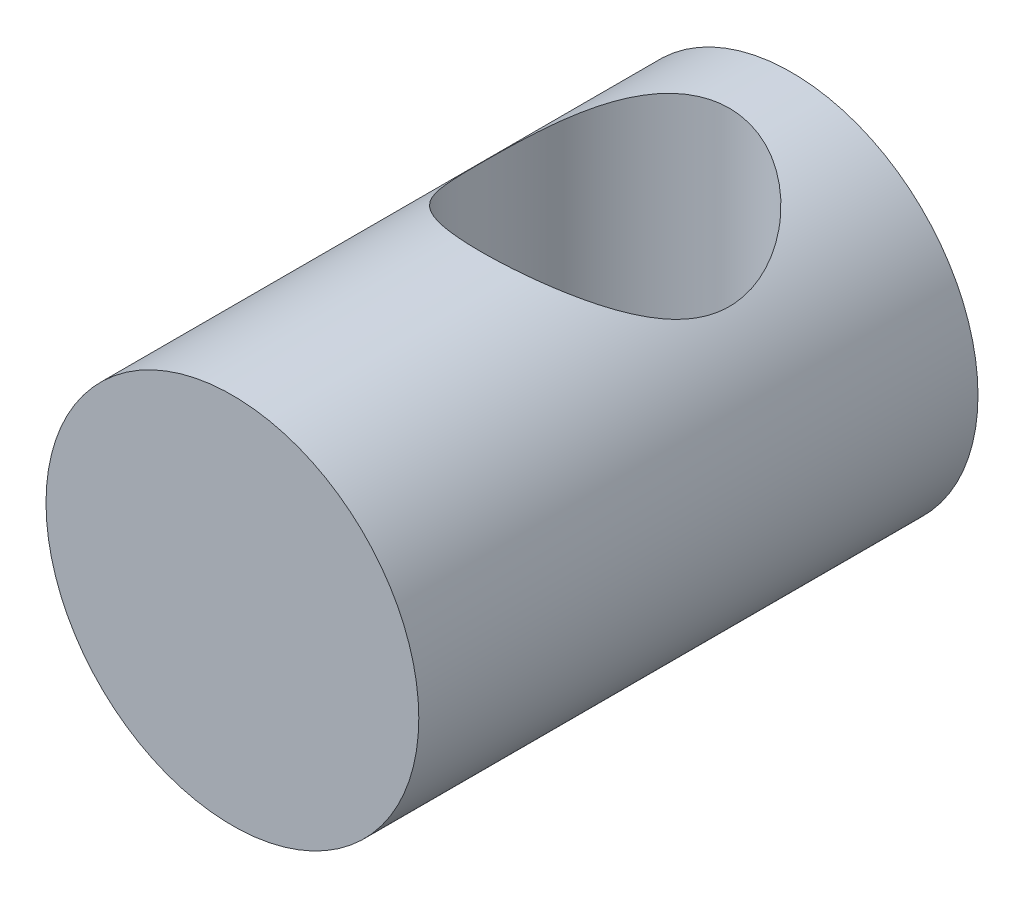
ISO-10303-21;
HEADER;
FILE_DESCRIPTION(('STEP AP214'),'2;1');
FILE_NAME('part.step','',(''),(''),'','','');
FILE_SCHEMA(('AUTOMOTIVE_DESIGN { 1 0 10303 214 1 1 1 1 }'));
ENDSEC;
DATA;
#1=APPLICATION_CONTEXT('core data for automotive mechanical design processes');
#2=APPLICATION_PROTOCOL_DEFINITION('international standard','automotive_design',2000,#1);
#3=PRODUCT_CONTEXT('',#1,'mechanical');
#4=PRODUCT('Part','Part','',(#3));
#5=PRODUCT_RELATED_PRODUCT_CATEGORY('part','',(#4));
#6=PRODUCT_DEFINITION_FORMATION('','',#4);
#7=PRODUCT_DEFINITION_CONTEXT('part definition',#1,'design');
#8=PRODUCT_DEFINITION('design','',#6,#7);
#9=PRODUCT_DEFINITION_SHAPE('','',#8);
#10=(LENGTH_UNIT() NAMED_UNIT(*) SI_UNIT(.MILLI.,.METRE.));
#11=(NAMED_UNIT(*) PLANE_ANGLE_UNIT() SI_UNIT($,.RADIAN.));
#12=(NAMED_UNIT(*) SI_UNIT($,.STERADIAN.) SOLID_ANGLE_UNIT());
#13=UNCERTAINTY_MEASURE_WITH_UNIT(LENGTH_MEASURE(1.E-05),#10,'distance_accuracy_value','');
#14=(GEOMETRIC_REPRESENTATION_CONTEXT(3) GLOBAL_UNCERTAINTY_ASSIGNED_CONTEXT((#13)) GLOBAL_UNIT_ASSIGNED_CONTEXT((#10,
#11,#12)) REPRESENTATION_CONTEXT('',''));
#15=CARTESIAN_POINT('',(0.,0.,0.));
#16=DIRECTION('',(0.,0.,1.));
#17=DIRECTION('',(1.,0.,0.));
#18=AXIS2_PLACEMENT_3D('',#15,#16,#17);
#19=CARTESIAN_POINT('',(0.,0.,-14.2875));
#20=DIRECTION('',(0.,0.,1.));
#21=DIRECTION('',(1.,0.,0.));
#22=AXIS2_PLACEMENT_3D('',#19,#20,#21);
#23=CYLINDRICAL_SURFACE('',#22,4.7625);
#24=CARTESIAN_POINT('',(0.,-4.7625,-12.7));
#25=CARTESIAN_POINT('',(-0.159513506146524,-4.76249829558772,-12.6999978538767));
#26=CARTESIAN_POINT('',(-0.319036822940595,-4.75441585981929,-12.6879120137824));
#27=CARTESIAN_POINT('',(-0.632990333269337,-4.72288699141972,-12.6403157875296));
#28=CARTESIAN_POINT('',(-0.787418072256467,-4.6994332647002,-12.6047942804673));
#29=CARTESIAN_POINT('',(-1.0861866118583,-4.63947623936465,-12.5125037833269));
#30=CARTESIAN_POINT('',(-1.23057094564588,-4.60303407934685,-12.4558342823537));
#31=CARTESIAN_POINT('',(-1.50719688917279,-4.52002748417047,-12.3236619686986));
#32=CARTESIAN_POINT('',(-1.63943673208792,-4.47346157948094,-12.2481564216004));
#33=CARTESIAN_POINT('',(-1.90068942785739,-4.36923384005694,-12.0734820944603));
#34=CARTESIAN_POINT('',(-2.0284762255929,-4.31096574538352,-11.9728490163642));
#35=CARTESIAN_POINT('',(-2.26651828028912,-4.19071922389352,-11.754278552468));
#36=CARTESIAN_POINT('',(-2.37674794067855,-4.12873555797057,-11.6363163752297));
#37=CARTESIAN_POINT('',(-2.59432897361932,-3.99618620055343,-11.3648293648552));
#38=CARTESIAN_POINT('',(-2.69848308269039,-3.92580920318787,-11.2086300251264));
#39=CARTESIAN_POINT('',(-2.87893691841686,-3.79546083955008,-10.8769731383985));
#40=CARTESIAN_POINT('',(-2.95528481583057,-3.73547157335729,-10.7015495876129));
#41=CARTESIAN_POINT('',(-3.0587003056751,-3.65087323287846,-10.3874708216265));
#42=CARTESIAN_POINT('',(-3.09363184983488,-3.62104984276855,-10.2528235810431));
#43=CARTESIAN_POINT('',(-3.14564105737718,-3.57597026836952,-9.97784309874219));
#44=CARTESIAN_POINT('',(-3.16274949511548,-3.56068897885195,-9.83752009390908));
#45=CARTESIAN_POINT('',(-3.17803790572636,-3.54705611398895,-9.55440878855361));
#46=CARTESIAN_POINT('',(-3.17614050629003,-3.54877374048434,-9.41161277524195));
#47=CARTESIAN_POINT('',(-3.1533716036927,-3.56901393593137,-9.12870447959653));
#48=CARTESIAN_POINT('',(-3.13248402562585,-3.58755074204361,-8.9885945736282));
#49=CARTESIAN_POINT('',(-3.07443178311274,-3.63739407712628,-8.7209835560414));
#50=CARTESIAN_POINT('',(-3.03802591942409,-3.66810112544892,-8.59319887882005));
#51=CARTESIAN_POINT('',(-2.95068813219861,-3.73871526235139,-8.34544989020324));
#52=CARTESIAN_POINT('',(-2.89975142875274,-3.77862537744388,-8.22548816814286));
#53=CARTESIAN_POINT('',(-2.77294687249444,-3.87293161809884,-7.97079718501153));
#54=CARTESIAN_POINT('',(-2.69411533030023,-3.92862304429405,-7.83802740802083));
#55=CARTESIAN_POINT('',(-2.51886974692605,-4.04322816135652,-7.58605385994608));
#56=CARTESIAN_POINT('',(-2.42243402035992,-4.10214576296336,-7.46686711829168));
#57=CARTESIAN_POINT('',(-2.19045099950254,-4.23137558230652,-7.21908870886798));
#58=CARTESIAN_POINT('',(-2.05095377025594,-4.30140657245416,-7.09400719771968));
#59=CARTESIAN_POINT('',(-1.74943769853673,-4.43258734804498,-6.8688005649166));
#60=CARTESIAN_POINT('',(-1.58744015020742,-4.493745420159,-6.76865209416239));
#61=CARTESIAN_POINT('',(-1.2777118005163,-4.59018328993748,-6.61435412168688));
#62=CARTESIAN_POINT('',(-1.13340775885306,-4.62818577100373,-6.55503616069962));
#63=CARTESIAN_POINT('',(-0.835082219747427,-4.69118503960837,-6.45778343056955));
#64=CARTESIAN_POINT('',(-0.681069057915084,-4.71619281752454,-6.41983058942756));
#65=CARTESIAN_POINT('',(-0.366689406911034,-4.75100462923954,-6.36720665018473));
#66=CARTESIAN_POINT('',(-0.206298501445474,-4.76074299407139,-6.35263610576051));
#67=CARTESIAN_POINT('',(0.115000912030583,-4.76381945007165,-6.34802024690749));
#68=CARTESIAN_POINT('',(0.275909383071218,-4.75715868774695,-6.35797321797411));
#69=CARTESIAN_POINT('',(0.581748451061771,-4.72915598211033,-6.40020318820457));
#70=CARTESIAN_POINT('',(0.727007443428386,-4.70887816144478,-6.43086296018629));
#71=CARTESIAN_POINT('',(1.00983477297833,-4.65643038239684,-6.51128315154554));
#72=CARTESIAN_POINT('',(1.14740187964354,-4.62425852748368,-6.561046617099));
#73=CARTESIAN_POINT('',(1.42028029136544,-4.54812959640013,-6.68123552155831));
#74=CARTESIAN_POINT('',(1.55495019310494,-4.50357668840463,-6.75272994460303));
#75=CARTESIAN_POINT('',(1.81083430052963,-4.40692945783369,-6.91266284779163));
#76=CARTESIAN_POINT('',(1.93204012275933,-4.35483048266614,-7.00111179235199));
#77=CARTESIAN_POINT('',(2.17781894704302,-4.23790342811906,-7.20821499069174));
#78=CARTESIAN_POINT('',(2.29989360271145,-4.17236523918599,-7.32943393783591));
#79=CARTESIAN_POINT('',(2.52307674305786,-4.04131737275621,-7.59001439509023));
#80=CARTESIAN_POINT('',(2.62417073664107,-3.97580774594569,-7.72938833720815));
#81=CARTESIAN_POINT('',(2.79598082787364,-3.85666740360083,-8.01233858015499));
#82=CARTESIAN_POINT('',(2.86854322403869,-3.80250060257811,-8.15456210271089));
#83=CARTESIAN_POINT('',(2.99237739257787,-3.70584371667973,-8.45164783616389));
#84=CARTESIAN_POINT('',(3.04368748566418,-3.66333266217137,-8.6064866910816));
#85=CARTESIAN_POINT('',(3.11524401668582,-3.60256467927561,-8.89724612217364));
#86=CARTESIAN_POINT('',(3.13941774208685,-3.58132059145467,-9.03156024390672));
#87=CARTESIAN_POINT('',(3.17022488831674,-3.55408653184003,-9.30366008835974));
#88=CARTESIAN_POINT('',(3.17687736084457,-3.54807999179148,-9.44144187574552));
#89=CARTESIAN_POINT('',(3.17220478264998,-3.55225668535638,-9.71652083672794));
#90=CARTESIAN_POINT('',(3.16086908702961,-3.56244950530632,-9.85381767515023));
#91=CARTESIAN_POINT('',(3.12097725174618,-3.59744096141944,-10.1240329106542));
#92=CARTESIAN_POINT('',(3.09239813794198,-3.6222590824651,-10.2569452164285));
#93=CARTESIAN_POINT('',(3.00978981561158,-3.69136350740653,-10.5500662289897));
#94=CARTESIAN_POINT('',(2.9510082914772,-3.7390752101256,-10.7081113219288));
#95=CARTESIAN_POINT('',(2.8112152810101,-3.84527739400296,-11.0100865236058));
#96=CARTESIAN_POINT('',(2.73017258412971,-3.90378297026142,-11.1539964271167));
#97=CARTESIAN_POINT('',(2.54632873237354,-4.02617059026332,-11.4288554963364));
#98=CARTESIAN_POINT('',(2.44315837250286,-4.09013111420676,-11.559521063736));
#99=CARTESIAN_POINT('',(2.21726660759134,-4.21685775015533,-11.8035913840574));
#100=CARTESIAN_POINT('',(2.09453921249742,-4.27962348959933,-11.9169908277243));
#101=CARTESIAN_POINT('',(1.88738506601081,-4.37333498138707,-12.0799185849831));
#102=CARTESIAN_POINT('',(1.80901344364311,-4.40641312548886,-12.1360276198673));
#103=CARTESIAN_POINT('',(1.64665981934885,-4.46961905722943,-12.2413377988571));
#104=CARTESIAN_POINT('',(1.56268042207705,-4.49974819878214,-12.2905421175234));
#105=CARTESIAN_POINT('',(1.38960715113394,-4.55616827072524,-12.3814235622438));
#106=CARTESIAN_POINT('',(1.30051812806184,-4.58246276002165,-12.4231076763622));
#107=CARTESIAN_POINT('',(1.11782960098097,-4.63042056995049,-12.4983567282061));
#108=CARTESIAN_POINT('',(1.02423169482463,-4.65208551661339,-12.5319245171684));
#109=CARTESIAN_POINT('',(0.780235392827383,-4.70058109652366,-12.6065413998412));
#110=CARTESIAN_POINT('',(0.627104096318102,-4.72362103868264,-12.6414276568918));
#111=CARTESIAN_POINT('',(0.315982580686498,-4.75457565287333,-12.6881493609694));
#112=CARTESIAN_POINT('',(0.157996102785212,-4.76250168819873,-12.7000021257078));
#113=CARTESIAN_POINT('',(0.,-4.7625,-12.7));
#114=B_SPLINE_CURVE_WITH_KNOTS('',3,(#24,#25,#26,#27,#28,#29,#30,#31,#32,#33,#34,#35,#36,#37,
#38,#39,#40,#41,#42,#43,#44,#45,#46,#47,#48,#49,#50,#51,#52,#53,#54,#55,#56,#57,#58,#59,#60,#61,
#62,#63,#64,#65,#66,#67,#68,#69,#70,#71,#72,#73,#74,#75,#76,#77,#78,#79,#80,#81,#82,#83,#84,#85,
#86,#87,#88,#89,#90,#91,#92,#93,#94,#95,#96,#97,#98,#99,#100,#101,#102,#103,#104,#105,#106,#107,
#108,#109,#110,#111,#112,#113),.UNSPECIFIED.,.T.,.F.,(4,2,2,2,2,2,2,2,2,2,2,2,2,2,2,2,2,2,2,2,2,
2,2,2,2,2,2,2,2,2,2,2,2,2,2,2,2,2,2,2,2,2,2,2,4),(0.,0.477921997077322,0.956070945278542,
1.43199826818949,1.90799472139476,2.42438283538384,2.94151703421856,3.54023109732372,
4.13790297394634,4.56300988710696,4.98738156455222,5.41348154879912,5.83994255655571,
6.24758818745149,6.6553680680092,7.14609274784494,7.63742604761198,8.23466340273952,
8.8313393398877,9.31106989228961,9.79039404549573,10.2717740223998,10.7531203456965,
11.2006552211841,11.6482614879236,12.1229810060221,12.5979944723587,13.1481222963466,
13.6986288317687,14.2025677230621,14.705593948025,15.1181442623597,15.5302458053914,
15.9425913096208,16.3554874162604,16.8784049132826,17.4020593249786,17.9352455177247,
18.4685953331297,18.7739424593009,19.0791487337135,19.3840699212457,19.6888838348844,
20.1626158186784,20.635991489477),.UNSPECIFIED.);
#115=CARTESIAN_POINT('',(0.,-4.7625,-12.7));
#116=VERTEX_POINT('',#115);
#117=EDGE_CURVE('E52',#116,#116,#114,.T.);
#118=ORIENTED_EDGE('',*,*,#117,.T.);
#119=EDGE_LOOP('',(#118));
#120=FACE_BOUND('',#119,.T.);
#121=CARTESIAN_POINT('',(0.,0.,-14.2875));
#122=DIRECTION('',(0.,0.,1.));
#123=DIRECTION('',(1.,0.,0.));
#124=AXIS2_PLACEMENT_3D('',#121,#122,#123);
#125=CIRCLE('',#124,4.7625);
#126=CARTESIAN_POINT('',(4.7625,0.,-14.2875));
#127=VERTEX_POINT('',#126);
#128=EDGE_CURVE('E10',#127,#127,#125,.T.);
#129=ORIENTED_EDGE('',*,*,#128,.T.);
#130=EDGE_LOOP('',(#129));
#131=FACE_BOUND('',#130,.T.);
#132=CARTESIAN_POINT('',(0.,0.,0.));
#133=DIRECTION('',(0.,0.,1.));
#134=DIRECTION('',(1.,0.,0.));
#135=AXIS2_PLACEMENT_3D('',#132,#133,#134);
#136=CIRCLE('',#135,4.7625);
#137=CARTESIAN_POINT('',(4.7625,0.,0.));
#138=VERTEX_POINT('',#137);
#139=EDGE_CURVE('E46',#138,#138,#136,.T.);
#140=ORIENTED_EDGE('',*,*,#139,.F.);
#141=EDGE_LOOP('',(#140));
#142=FACE_BOUND('',#141,.T.);
#143=CARTESIAN_POINT('',(0.,4.7625,-12.7));
#144=CARTESIAN_POINT('',(0.159513506146528,4.76249829558772,-12.6999978538767));
#145=CARTESIAN_POINT('',(0.319036822940599,4.75441585981929,-12.6879120137824));
#146=CARTESIAN_POINT('',(0.63299033326934,4.72288699141972,-12.6403157875296));
#147=CARTESIAN_POINT('',(0.78741807225647,4.6994332647002,-12.6047942804673));
#148=CARTESIAN_POINT('',(1.08618661185831,4.63947623936465,-12.5125037833269));
#149=CARTESIAN_POINT('',(1.23057094564588,4.60303407934685,-12.4558342823537));
#150=CARTESIAN_POINT('',(1.50719688917279,4.52002748417047,-12.3236619686986));
#151=CARTESIAN_POINT('',(1.63943673208792,4.47346157948094,-12.2481564216004));
#152=CARTESIAN_POINT('',(1.9006894278574,4.36923384005694,-12.0734820944603));
#153=CARTESIAN_POINT('',(2.0284762255929,4.31096574538352,-11.9728490163642));
#154=CARTESIAN_POINT('',(2.26651828028912,4.19071922389352,-11.754278552468));
#155=CARTESIAN_POINT('',(2.37674794067855,4.12873555797056,-11.6363163752297));
#156=CARTESIAN_POINT('',(2.59432897361933,3.99618620055343,-11.3648293648552));
#157=CARTESIAN_POINT('',(2.69848308269039,3.92580920318787,-11.2086300251264));
#158=CARTESIAN_POINT('',(2.87893691841686,3.79546083955007,-10.8769731383985));
#159=CARTESIAN_POINT('',(2.95528481583058,3.73547157335728,-10.7015495876129));
#160=CARTESIAN_POINT('',(3.0587003056751,3.65087323287846,-10.3874708216265));
#161=CARTESIAN_POINT('',(3.09363184983489,3.62104984276855,-10.2528235810431));
#162=CARTESIAN_POINT('',(3.14564105737718,3.57597026836952,-9.97784309874219));
#163=CARTESIAN_POINT('',(3.16274949511548,3.56068897885195,-9.83752009390908));
#164=CARTESIAN_POINT('',(3.17803790572636,3.54705611398895,-9.55440878855361));
#165=CARTESIAN_POINT('',(3.17614050629003,3.54877374048434,-9.41161277524195));
#166=CARTESIAN_POINT('',(3.1533716036927,3.56901393593137,-9.12870447959654));
#167=CARTESIAN_POINT('',(3.13248402562585,3.58755074204361,-8.9885945736282));
#168=CARTESIAN_POINT('',(3.07443178311275,3.63739407712628,-8.72098355604141));
#169=CARTESIAN_POINT('',(3.03802591942409,3.66810112544891,-8.59319887882005));
#170=CARTESIAN_POINT('',(2.95068813219861,3.73871526235138,-8.34544989020324));
#171=CARTESIAN_POINT('',(2.89975142875275,3.77862537744388,-8.22548816814286));
#172=CARTESIAN_POINT('',(2.77294687249445,3.87293161809884,-7.97079718501153));
#173=CARTESIAN_POINT('',(2.69411533030023,3.92862304429405,-7.83802740802084));
#174=CARTESIAN_POINT('',(2.51886974692605,4.04322816135651,-7.58605385994609));
#175=CARTESIAN_POINT('',(2.42243402035992,4.10214576296336,-7.46686711829169));
#176=CARTESIAN_POINT('',(2.19045099950255,4.23137558230652,-7.21908870886799));
#177=CARTESIAN_POINT('',(2.05095377025594,4.30140657245415,-7.09400719771968));
#178=CARTESIAN_POINT('',(1.74943769853674,4.43258734804498,-6.8688005649166));
#179=CARTESIAN_POINT('',(1.58744015020743,4.493745420159,-6.76865209416239));
#180=CARTESIAN_POINT('',(1.27771180051631,4.59018328993748,-6.61435412168689));
#181=CARTESIAN_POINT('',(1.13340775885306,4.62818577100373,-6.55503616069962));
#182=CARTESIAN_POINT('',(0.835082219747434,4.69118503960837,-6.45778343056955));
#183=CARTESIAN_POINT('',(0.68106905791509,4.71619281752454,-6.41983058942756));
#184=CARTESIAN_POINT('',(0.36668940691104,4.75100462923954,-6.36720665018473));
#185=CARTESIAN_POINT('',(0.206298501445481,4.76074299407139,-6.35263610576051));
#186=CARTESIAN_POINT('',(-0.115000912030577,4.76381945007165,-6.3480202469075));
#187=CARTESIAN_POINT('',(-0.275909383071212,4.75715868774695,-6.35797321797411));
#188=CARTESIAN_POINT('',(-0.581748451061767,4.72915598211033,-6.40020318820457));
#189=CARTESIAN_POINT('',(-0.727007443428381,4.70887816144478,-6.43086296018629));
#190=CARTESIAN_POINT('',(-1.00983477297832,4.65643038239684,-6.51128315154554));
#191=CARTESIAN_POINT('',(-1.14740187964354,4.62425852748368,-6.561046617099));
#192=CARTESIAN_POINT('',(-1.42028029136543,4.54812959640013,-6.68123552155831));
#193=CARTESIAN_POINT('',(-1.55495019310494,4.50357668840464,-6.75272994460303));
#194=CARTESIAN_POINT('',(-1.81083430052962,4.40692945783369,-6.91266284779163));
#195=CARTESIAN_POINT('',(-1.93204012275932,4.35483048266614,-7.00111179235199));
#196=CARTESIAN_POINT('',(-2.17781894704302,4.23790342811906,-7.20821499069173));
#197=CARTESIAN_POINT('',(-2.29989360271144,4.172365239186,-7.32943393783591));
#198=CARTESIAN_POINT('',(-2.52307674305786,4.04131737275621,-7.59001439509023));
#199=CARTESIAN_POINT('',(-2.62417073664106,3.9758077459457,-7.72938833720815));
#200=CARTESIAN_POINT('',(-2.79598082787363,3.85666740360083,-8.01233858015499));
#201=CARTESIAN_POINT('',(-2.86854322403869,3.80250060257811,-8.15456210271089));
#202=CARTESIAN_POINT('',(-2.99237739257786,3.70584371667973,-8.45164783616389));
#203=CARTESIAN_POINT('',(-3.04368748566418,3.66333266217138,-8.6064866910816));
#204=CARTESIAN_POINT('',(-3.11524401668582,3.60256467927562,-8.89724612217364));
#205=CARTESIAN_POINT('',(-3.13941774208684,3.58132059145467,-9.03156024390672));
#206=CARTESIAN_POINT('',(-3.17022488831674,3.55408653184003,-9.30366008835974));
#207=CARTESIAN_POINT('',(-3.17687736084456,3.54807999179148,-9.44144187574552));
#208=CARTESIAN_POINT('',(-3.17220478264998,3.55225668535638,-9.71652083672794));
#209=CARTESIAN_POINT('',(-3.16086908702961,3.56244950530632,-9.85381767515024));
#210=CARTESIAN_POINT('',(-3.12097725174618,3.59744096141944,-10.1240329106542));
#211=CARTESIAN_POINT('',(-3.09239813794198,3.6222590824651,-10.2569452164285));
#212=CARTESIAN_POINT('',(-3.00978981561158,3.69136350740653,-10.5500662289897));
#213=CARTESIAN_POINT('',(-2.9510082914772,3.7390752101256,-10.7081113219288));
#214=CARTESIAN_POINT('',(-2.81121528101009,3.84527739400297,-11.0100865236058));
#215=CARTESIAN_POINT('',(-2.7301725841297,3.90378297026142,-11.1539964271167));
#216=CARTESIAN_POINT('',(-2.54632873237354,4.02617059026332,-11.4288554963364));
#217=CARTESIAN_POINT('',(-2.44315837250285,4.09013111420677,-11.5595210637361));
#218=CARTESIAN_POINT('',(-2.21726660759133,4.21685775015533,-11.8035913840574));
#219=CARTESIAN_POINT('',(-2.09453921249741,4.27962348959933,-11.9169908277243));
#220=CARTESIAN_POINT('',(-1.88738506601081,4.37333498138708,-12.0799185849831));
#221=CARTESIAN_POINT('',(-1.8090134436431,4.40641312548886,-12.1360276198673));
#222=CARTESIAN_POINT('',(-1.64665981934885,4.46961905722943,-12.2413377988571));
#223=CARTESIAN_POINT('',(-1.56268042207705,4.49974819878214,-12.2905421175234));
#224=CARTESIAN_POINT('',(-1.38960715113394,4.55616827072524,-12.3814235622438));
#225=CARTESIAN_POINT('',(-1.30051812806184,4.58246276002165,-12.4231076763622));
#226=CARTESIAN_POINT('',(-1.11782960098097,4.63042056995049,-12.4983567282061));
#227=CARTESIAN_POINT('',(-1.02423169482463,4.65208551661339,-12.5319245171684));
#228=CARTESIAN_POINT('',(-0.780235392827379,4.70058109652366,-12.6065413998412));
#229=CARTESIAN_POINT('',(-0.627104096318098,4.72362103868264,-12.6414276568918));
#230=CARTESIAN_POINT('',(-0.315982580686494,4.75457565287333,-12.6881493609694));
#231=CARTESIAN_POINT('',(-0.157996102785208,4.76250168819873,-12.7000021257078));
#232=CARTESIAN_POINT('',(0.,4.7625,-12.7));
#233=B_SPLINE_CURVE_WITH_KNOTS('',3,(#143,#144,#145,#146,#147,#148,#149,#150,#151,#152,#153,
#154,#155,#156,#157,#158,#159,#160,#161,#162,#163,#164,#165,#166,#167,#168,#169,#170,#171,#172,
#173,#174,#175,#176,#177,#178,#179,#180,#181,#182,#183,#184,#185,#186,#187,#188,#189,#190,#191,
#192,#193,#194,#195,#196,#197,#198,#199,#200,#201,#202,#203,#204,#205,#206,#207,#208,#209,#210,
#211,#212,#213,#214,#215,#216,#217,#218,#219,#220,#221,#222,#223,#224,#225,#226,#227,#228,#229,
#230,#231,#232),.UNSPECIFIED.,.T.,.F.,(4,2,2,2,2,2,2,2,2,2,2,2,2,2,2,2,2,2,2,2,2,2,2,2,2,2,2,2,
2,2,2,2,2,2,2,2,2,2,2,2,2,2,2,2,4),(0.,0.477921997077322,0.956070945278542,1.43199826818949,
1.90799472139476,2.42438283538384,2.94151703421856,3.54023109732372,4.13790297394634,
4.56300988710696,4.98738156455222,5.41348154879912,5.83994255655571,6.24758818745149,
6.65536806800919,7.14609274784494,7.63742604761197,8.23466340273951,8.8313393398877,
9.31106989228961,9.79039404549573,10.2717740223998,10.7531203456965,11.2006552211841,
11.6482614879236,12.1229810060221,12.5979944723587,13.1481222963466,13.6986288317687,
14.2025677230621,14.705593948025,15.1181442623597,15.5302458053914,15.9425913096208,
16.3554874162604,16.8784049132826,17.4020593249786,17.9352455177248,18.4685953331297,
18.7739424593009,19.0791487337135,19.3840699212457,19.6888838348845,20.1626158186784,
20.635991489477),.UNSPECIFIED.);
#234=CARTESIAN_POINT('',(0.,4.7625,-12.7));
#235=VERTEX_POINT('',#234);
#236=EDGE_CURVE('E38',#235,#235,#233,.T.);
#237=ORIENTED_EDGE('',*,*,#236,.T.);
#238=EDGE_LOOP('',(#237));
#239=FACE_BOUND('',#238,.T.);
#240=ADVANCED_FACE('F34',(#120,#131,#142,#239),#23,.T.);
#241=CARTESIAN_POINT('',(0.,0.,-14.2875));
#242=DIRECTION('',(0.,0.,1.));
#243=DIRECTION('',(1.,0.,0.));
#244=AXIS2_PLACEMENT_3D('',#241,#242,#243);
#245=PLANE('',#244);
#246=ORIENTED_EDGE('',*,*,#128,.F.);
#247=EDGE_LOOP('',(#246));
#248=FACE_BOUND('',#247,.T.);
#249=ADVANCED_FACE('F63',(#248),#245,.F.);
#250=CARTESIAN_POINT('',(0.,0.,0.));
#251=DIRECTION('',(0.,0.,1.));
#252=DIRECTION('',(1.,0.,0.));
#253=AXIS2_PLACEMENT_3D('',#250,#251,#252);
#254=PLANE('',#253);
#255=ORIENTED_EDGE('',*,*,#139,.T.);
#256=EDGE_LOOP('',(#255));
#257=FACE_BOUND('',#256,.T.);
#258=ADVANCED_FACE('F61',(#257),#254,.T.);
#259=CARTESIAN_POINT('',(0.,7.14375,-9.525));
#260=DIRECTION('',(0.,-1.,0.));
#261=DIRECTION('',(0.,0.,-1.));
#262=AXIS2_PLACEMENT_3D('',#259,#260,#261);
#263=CYLINDRICAL_SURFACE('',#262,3.175);
#264=ORIENTED_EDGE('',*,*,#236,.F.);
#265=EDGE_LOOP('',(#264));
#266=FACE_BOUND('',#265,.T.);
#267=ORIENTED_EDGE('',*,*,#117,.F.);
#268=EDGE_LOOP('',(#267));
#269=FACE_BOUND('',#268,.T.);
#270=ADVANCED_FACE('F57',(#266,#269),#263,.F.);
#271=CLOSED_SHELL('',(#240,#249,#258,#270));
#272=MANIFOLD_SOLID_BREP('B2',#271);
#273=ADVANCED_BREP_SHAPE_REPRESENTATION('',(#18,#272),#14);
#274=SHAPE_DEFINITION_REPRESENTATION(#9,#273);
ENDSEC;
END-ISO-10303-21;
